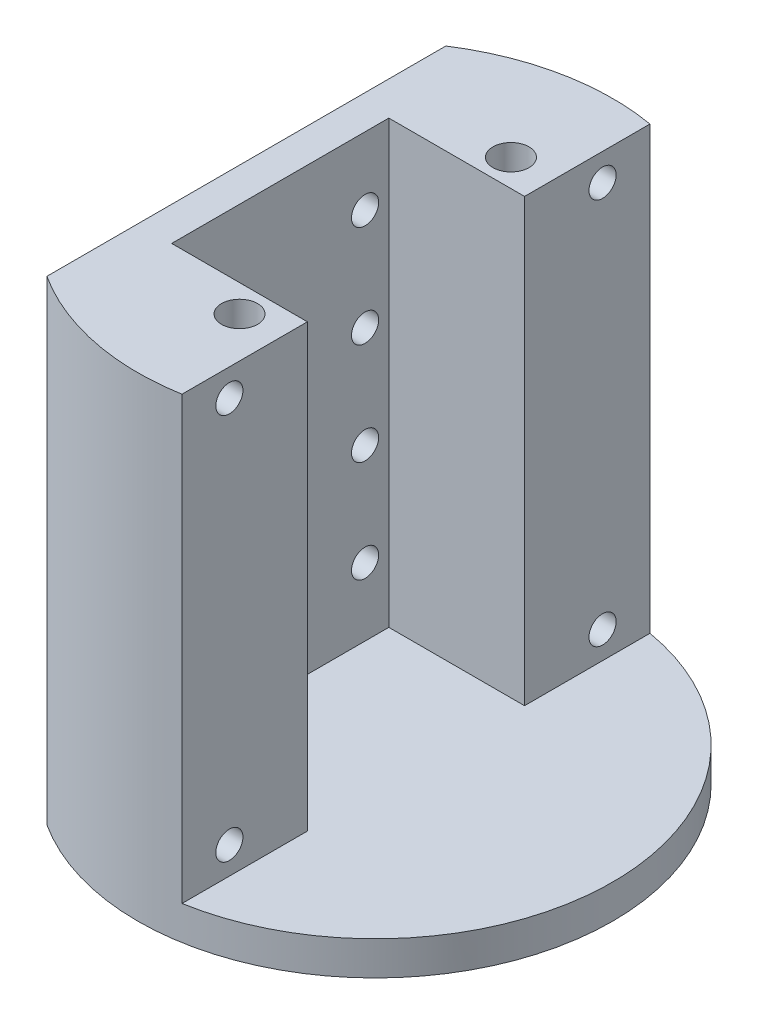
ISO-10303-21;
HEADER;
FILE_DESCRIPTION(('STEP AP214'),'2;1');
FILE_NAME('part.step','',(''),(''),'','','');
FILE_SCHEMA(('AUTOMOTIVE_DESIGN { 1 0 10303 214 1 1 1 1 }'));
ENDSEC;
DATA;
#1=APPLICATION_CONTEXT('core data for automotive mechanical design processes');
#2=APPLICATION_PROTOCOL_DEFINITION('international standard','automotive_design',2000,#1);
#3=PRODUCT_CONTEXT('',#1,'mechanical');
#4=PRODUCT('Part','Part','',(#3));
#5=PRODUCT_RELATED_PRODUCT_CATEGORY('part','',(#4));
#6=PRODUCT_DEFINITION_FORMATION('','',#4);
#7=PRODUCT_DEFINITION_CONTEXT('part definition',#1,'design');
#8=PRODUCT_DEFINITION('design','',#6,#7);
#9=PRODUCT_DEFINITION_SHAPE('','',#8);
#10=(LENGTH_UNIT() NAMED_UNIT(*) SI_UNIT(.MILLI.,.METRE.));
#11=(NAMED_UNIT(*) PLANE_ANGLE_UNIT() SI_UNIT($,.RADIAN.));
#12=(NAMED_UNIT(*) SI_UNIT($,.STERADIAN.) SOLID_ANGLE_UNIT());
#13=UNCERTAINTY_MEASURE_WITH_UNIT(LENGTH_MEASURE(1.E-05),#10,'distance_accuracy_value','');
#14=(GEOMETRIC_REPRESENTATION_CONTEXT(3) GLOBAL_UNCERTAINTY_ASSIGNED_CONTEXT((#13)) GLOBAL_UNIT_ASSIGNED_CONTEXT((#10,
#11,#12)) REPRESENTATION_CONTEXT('',''));
#15=CARTESIAN_POINT('',(0.,0.,0.));
#16=DIRECTION('',(0.,0.,1.));
#17=DIRECTION('',(1.,0.,0.));
#18=AXIS2_PLACEMENT_3D('',#15,#16,#17);
#19=CARTESIAN_POINT('',(7.62,88.9,0.));
#20=DIRECTION('',(-1.,0.,0.));
#21=DIRECTION('',(0.,0.,1.));
#22=AXIS2_PLACEMENT_3D('',#19,#20,#21);
#23=PLANE('',#22);
#24=CARTESIAN_POINT('',(7.62,11.43,-34.925));
#25=DIRECTION('',(1.,0.,0.));
#26=DIRECTION('',(0.,0.,-1.));
#27=AXIS2_PLACEMENT_3D('',#24,#25,#26);
#28=CIRCLE('',#27,2.54);
#29=CARTESIAN_POINT('',(7.62,11.43,-37.465));
#30=VERTEX_POINT('',#29);
#31=EDGE_CURVE('E147',#30,#30,#28,.T.);
#32=ORIENTED_EDGE('',*,*,#31,.F.);
#33=EDGE_LOOP('',(#32));
#34=FACE_BOUND('',#33,.T.);
#35=CARTESIAN_POINT('',(7.62,83.82,-34.925));
#36=DIRECTION('',(1.,0.,0.));
#37=DIRECTION('',(0.,0.,-1.));
#38=AXIS2_PLACEMENT_3D('',#35,#36,#37);
#39=CIRCLE('',#38,2.54);
#40=CARTESIAN_POINT('',(7.62,83.82,-37.465));
#41=VERTEX_POINT('',#40);
#42=EDGE_CURVE('E150',#41,#41,#39,.T.);
#43=ORIENTED_EDGE('',*,*,#42,.F.);
#44=EDGE_LOOP('',(#43));
#45=FACE_BOUND('',#44,.T.);
#46=DIRECTION('',(0.,0.,-1.));
#47=VECTOR('',#46,1.);
#48=CARTESIAN_POINT('',(7.62,6.35,-20.32));
#49=LINE('',#48,#47);
#50=CARTESIAN_POINT('',(7.62,6.34999999999999,-20.32));
#51=VERTEX_POINT('',#50);
#52=CARTESIAN_POINT('',(7.62,6.34999999999999,-43.7919867098993));
#53=VERTEX_POINT('',#52);
#54=EDGE_CURVE('E62',#51,#53,#49,.T.);
#55=ORIENTED_EDGE('',*,*,#54,.T.);
#56=DIRECTION('',(0.,-1.,0.));
#57=VECTOR('',#56,1.);
#58=CARTESIAN_POINT('',(7.62,88.9,-43.7919867098993));
#59=LINE('',#58,#57);
#60=CARTESIAN_POINT('',(7.62,88.9,-43.7919867098993));
#61=VERTEX_POINT('',#60);
#62=EDGE_CURVE('E11',#61,#53,#59,.T.);
#63=ORIENTED_EDGE('',*,*,#62,.F.);
#64=DIRECTION('',(0.,0.,-1.));
#65=VECTOR('',#64,1.);
#66=CARTESIAN_POINT('',(7.62,88.9,0.));
#67=LINE('',#66,#65);
#68=CARTESIAN_POINT('',(7.62,88.9,-20.32));
#69=VERTEX_POINT('',#68);
#70=EDGE_CURVE('E123',#69,#61,#67,.T.);
#71=ORIENTED_EDGE('',*,*,#70,.F.);
#72=DIRECTION('',(0.,-1.,0.));
#73=VECTOR('',#72,1.);
#74=CARTESIAN_POINT('',(7.62,88.9,-20.32));
#75=LINE('',#74,#73);
#76=EDGE_CURVE('E276',#69,#51,#75,.T.);
#77=ORIENTED_EDGE('',*,*,#76,.T.);
#78=EDGE_LOOP('',(#55,#63,#71,#77));
#79=FACE_BOUND('',#78,.T.);
#80=ADVANCED_FACE('F47',(#34,#45,#79),#23,.F.);
#81=CARTESIAN_POINT('',(7.62000000000001,88.9,0.));
#82=DIRECTION('',(1.,0.,0.));
#83=DIRECTION('',(0.,0.,-1.));
#84=AXIS2_PLACEMENT_3D('',#81,#82,#83);
#85=PLANE('',#84);
#86=CARTESIAN_POINT('',(7.62,11.43,34.925));
#87=DIRECTION('',(1.,0.,0.));
#88=DIRECTION('',(0.,0.,-1.));
#89=AXIS2_PLACEMENT_3D('',#86,#87,#88);
#90=CIRCLE('',#89,2.54);
#91=CARTESIAN_POINT('',(7.62,11.43,32.385));
#92=VERTEX_POINT('',#91);
#93=EDGE_CURVE('E638',#92,#92,#90,.T.);
#94=ORIENTED_EDGE('',*,*,#93,.F.);
#95=EDGE_LOOP('',(#94));
#96=FACE_BOUND('',#95,.T.);
#97=CARTESIAN_POINT('',(7.62,83.82,34.925));
#98=DIRECTION('',(1.,0.,0.));
#99=DIRECTION('',(0.,0.,-1.));
#100=AXIS2_PLACEMENT_3D('',#97,#98,#99);
#101=CIRCLE('',#100,2.54);
#102=CARTESIAN_POINT('',(7.62,83.82,32.385));
#103=VERTEX_POINT('',#102);
#104=EDGE_CURVE('E154',#103,#103,#101,.T.);
#105=ORIENTED_EDGE('',*,*,#104,.F.);
#106=EDGE_LOOP('',(#105));
#107=FACE_BOUND('',#106,.T.);
#108=DIRECTION('',(0.,-1.,0.));
#109=VECTOR('',#108,1.);
#110=CARTESIAN_POINT('',(7.62,88.9,43.7919867098993));
#111=LINE('',#110,#109);
#112=CARTESIAN_POINT('',(7.62,88.9,43.7919867098993));
#113=VERTEX_POINT('',#112);
#114=CARTESIAN_POINT('',(7.62,6.34999999999999,43.7919867098993));
#115=VERTEX_POINT('',#114);
#116=EDGE_CURVE('E69',#113,#115,#111,.T.);
#117=ORIENTED_EDGE('',*,*,#116,.T.);
#118=DIRECTION('',(0.,0.,-1.));
#119=VECTOR('',#118,1.);
#120=CARTESIAN_POINT('',(7.62,6.35,20.32));
#121=LINE('',#120,#119);
#122=CARTESIAN_POINT('',(7.62,6.34999999999999,20.32));
#123=VERTEX_POINT('',#122);
#124=EDGE_CURVE('E173',#115,#123,#121,.T.);
#125=ORIENTED_EDGE('',*,*,#124,.T.);
#126=DIRECTION('',(0.,-1.,0.));
#127=VECTOR('',#126,1.);
#128=CARTESIAN_POINT('',(7.62,88.9,20.32));
#129=LINE('',#128,#127);
#130=CARTESIAN_POINT('',(7.62,88.9,20.32));
#131=VERTEX_POINT('',#130);
#132=EDGE_CURVE('E291',#131,#123,#129,.T.);
#133=ORIENTED_EDGE('',*,*,#132,.F.);
#134=DIRECTION('',(0.,0.,1.));
#135=VECTOR('',#134,1.);
#136=CARTESIAN_POINT('',(7.62000000000001,88.9,0.));
#137=LINE('',#136,#135);
#138=EDGE_CURVE('E265',#131,#113,#137,.T.);
#139=ORIENTED_EDGE('',*,*,#138,.T.);
#140=EDGE_LOOP('',(#117,#125,#133,#139));
#141=FACE_BOUND('',#140,.T.);
#142=ADVANCED_FACE('F135',(#96,#107,#141),#85,.T.);
#143=CARTESIAN_POINT('',(0.,88.9,20.32));
#144=DIRECTION('',(0.,0.,1.));
#145=DIRECTION('',(1.,0.,0.));
#146=AXIS2_PLACEMENT_3D('',#143,#144,#145);
#147=PLANE('',#146);
#148=DIRECTION('',(-1.,0.,0.));
#149=VECTOR('',#148,1.);
#150=CARTESIAN_POINT('',(7.62,6.35,20.32));
#151=LINE('',#150,#149);
#152=CARTESIAN_POINT('',(-17.78,6.34999999999999,20.32));
#153=VERTEX_POINT('',#152);
#154=EDGE_CURVE('E176',#123,#153,#151,.T.);
#155=ORIENTED_EDGE('',*,*,#154,.T.);
#156=DIRECTION('',(0.,-1.,0.));
#157=VECTOR('',#156,1.);
#158=CARTESIAN_POINT('',(-17.78,88.9,20.32));
#159=LINE('',#158,#157);
#160=CARTESIAN_POINT('',(-17.78,88.9,20.32));
#161=VERTEX_POINT('',#160);
#162=EDGE_CURVE('E287',#161,#153,#159,.T.);
#163=ORIENTED_EDGE('',*,*,#162,.F.);
#164=DIRECTION('',(-1.,0.,0.));
#165=VECTOR('',#164,1.);
#166=CARTESIAN_POINT('',(0.,88.9,20.32));
#167=LINE('',#166,#165);
#168=EDGE_CURVE('E268',#131,#161,#167,.T.);
#169=ORIENTED_EDGE('',*,*,#168,.F.);
#170=ORIENTED_EDGE('',*,*,#132,.T.);
#171=EDGE_LOOP('',(#155,#163,#169,#170));
#172=FACE_BOUND('',#171,.T.);
#173=ADVANCED_FACE('F141',(#172),#147,.F.);
#174=CARTESIAN_POINT('',(-17.78,88.9,0.));
#175=DIRECTION('',(-1.,0.,0.));
#176=DIRECTION('',(0.,0.,1.));
#177=AXIS2_PLACEMENT_3D('',#174,#175,#176);
#178=PLANE('',#177);
#179=CARTESIAN_POINT('',(-17.78,76.2,15.8750000000005));
#180=DIRECTION('',(1.,0.,0.));
#181=DIRECTION('',(0.,0.,-1.));
#182=AXIS2_PLACEMENT_3D('',#179,#180,#181);
#183=CIRCLE('',#182,2.54);
#184=CARTESIAN_POINT('',(-17.78,76.2,13.3350000000005));
#185=VERTEX_POINT('',#184);
#186=EDGE_CURVE('E243',#185,#185,#183,.T.);
#187=ORIENTED_EDGE('',*,*,#186,.F.);
#188=EDGE_LOOP('',(#187));
#189=FACE_BOUND('',#188,.T.);
#190=CARTESIAN_POINT('',(-17.78,38.1,-15.8749999999999));
#191=DIRECTION('',(1.,0.,0.));
#192=DIRECTION('',(0.,0.,-1.));
#193=AXIS2_PLACEMENT_3D('',#190,#191,#192);
#194=CIRCLE('',#193,2.54);
#195=CARTESIAN_POINT('',(-17.78,38.1,-18.4149999999999));
#196=VERTEX_POINT('',#195);
#197=EDGE_CURVE('E207',#196,#196,#194,.T.);
#198=ORIENTED_EDGE('',*,*,#197,.F.);
#199=EDGE_LOOP('',(#198));
#200=FACE_BOUND('',#199,.T.);
#201=CARTESIAN_POINT('',(-17.78,19.05,15.8749999999999));
#202=DIRECTION('',(1.,0.,0.));
#203=DIRECTION('',(0.,0.,-1.));
#204=AXIS2_PLACEMENT_3D('',#201,#202,#203);
#205=CIRCLE('',#204,2.54);
#206=CARTESIAN_POINT('',(-17.78,19.05,13.3349999999999));
#207=VERTEX_POINT('',#206);
#208=EDGE_CURVE('E216',#207,#207,#205,.T.);
#209=ORIENTED_EDGE('',*,*,#208,.F.);
#210=EDGE_LOOP('',(#209));
#211=FACE_BOUND('',#210,.T.);
#212=CARTESIAN_POINT('',(-17.78,19.05,-15.8750000000001));
#213=DIRECTION('',(1.,0.,0.));
#214=DIRECTION('',(0.,0.,-1.));
#215=AXIS2_PLACEMENT_3D('',#212,#213,#214);
#216=CIRCLE('',#215,2.54);
#217=CARTESIAN_POINT('',(-17.78,19.05,-18.4150000000001));
#218=VERTEX_POINT('',#217);
#219=EDGE_CURVE('E199',#218,#218,#216,.T.);
#220=ORIENTED_EDGE('',*,*,#219,.F.);
#221=EDGE_LOOP('',(#220));
#222=FACE_BOUND('',#221,.T.);
#223=CARTESIAN_POINT('',(-17.78,76.2,-15.8749999999995));
#224=DIRECTION('',(1.,0.,0.));
#225=DIRECTION('',(0.,0.,-1.));
#226=AXIS2_PLACEMENT_3D('',#223,#224,#225);
#227=CIRCLE('',#226,2.54);
#228=CARTESIAN_POINT('',(-17.78,76.2,-18.4149999999995));
#229=VERTEX_POINT('',#228);
#230=EDGE_CURVE('E239',#229,#229,#227,.T.);
#231=ORIENTED_EDGE('',*,*,#230,.F.);
#232=EDGE_LOOP('',(#231));
#233=FACE_BOUND('',#232,.T.);
#234=CARTESIAN_POINT('',(-17.78,57.15,15.8750000000003));
#235=DIRECTION('',(1.,0.,0.));
#236=DIRECTION('',(0.,0.,-1.));
#237=AXIS2_PLACEMENT_3D('',#234,#235,#236);
#238=CIRCLE('',#237,2.54);
#239=CARTESIAN_POINT('',(-17.78,57.15,13.3350000000003));
#240=VERTEX_POINT('',#239);
#241=EDGE_CURVE('E248',#240,#240,#238,.T.);
#242=ORIENTED_EDGE('',*,*,#241,.F.);
#243=EDGE_LOOP('',(#242));
#244=FACE_BOUND('',#243,.T.);
#245=CARTESIAN_POINT('',(-17.78,57.15,-15.8749999999997));
#246=DIRECTION('',(1.,0.,0.));
#247=DIRECTION('',(0.,0.,-1.));
#248=AXIS2_PLACEMENT_3D('',#245,#246,#247);
#249=CIRCLE('',#248,2.54);
#250=CARTESIAN_POINT('',(-17.78,57.15,-18.4149999999997));
#251=VERTEX_POINT('',#250);
#252=EDGE_CURVE('E223',#251,#251,#249,.T.);
#253=ORIENTED_EDGE('',*,*,#252,.F.);
#254=EDGE_LOOP('',(#253));
#255=FACE_BOUND('',#254,.T.);
#256=CARTESIAN_POINT('',(-17.78,38.1,15.8750000000001));
#257=DIRECTION('',(1.,0.,0.));
#258=DIRECTION('',(0.,0.,-1.));
#259=AXIS2_PLACEMENT_3D('',#256,#257,#258);
#260=CIRCLE('',#259,2.54);
#261=CARTESIAN_POINT('',(-17.78,38.1,13.3350000000001));
#262=VERTEX_POINT('',#261);
#263=EDGE_CURVE('E232',#262,#262,#260,.T.);
#264=ORIENTED_EDGE('',*,*,#263,.F.);
#265=EDGE_LOOP('',(#264));
#266=FACE_BOUND('',#265,.T.);
#267=DIRECTION('',(0.,0.,-1.));
#268=VECTOR('',#267,1.);
#269=CARTESIAN_POINT('',(-17.78,6.35,20.32));
#270=LINE('',#269,#268);
#271=CARTESIAN_POINT('',(-17.78,6.34999999999999,-20.32));
#272=VERTEX_POINT('',#271);
#273=EDGE_CURVE('E179',#153,#272,#270,.T.);
#274=ORIENTED_EDGE('',*,*,#273,.T.);
#275=DIRECTION('',(0.,-1.,0.));
#276=VECTOR('',#275,1.);
#277=CARTESIAN_POINT('',(-17.78,88.9,-20.32));
#278=LINE('',#277,#276);
#279=CARTESIAN_POINT('',(-17.78,88.9,-20.32));
#280=VERTEX_POINT('',#279);
#281=EDGE_CURVE('E283',#280,#272,#278,.T.);
#282=ORIENTED_EDGE('',*,*,#281,.F.);
#283=DIRECTION('',(0.,0.,-1.));
#284=VECTOR('',#283,1.);
#285=CARTESIAN_POINT('',(-17.78,88.9,0.));
#286=LINE('',#285,#284);
#287=EDGE_CURVE('E271',#161,#280,#286,.T.);
#288=ORIENTED_EDGE('',*,*,#287,.F.);
#289=ORIENTED_EDGE('',*,*,#162,.T.);
#290=EDGE_LOOP('',(#274,#282,#288,#289));
#291=FACE_BOUND('',#290,.T.);
#292=ADVANCED_FACE('F320',(#189,#200,#211,#222,#233,#244,#255,#266,#291),#178,.F.);
#293=CARTESIAN_POINT('',(0.,88.9,-20.32));
#294=DIRECTION('',(0.,0.,1.));
#295=DIRECTION('',(1.,0.,0.));
#296=AXIS2_PLACEMENT_3D('',#293,#294,#295);
#297=PLANE('',#296);
#298=ORIENTED_EDGE('',*,*,#281,.T.);
#299=DIRECTION('',(1.,0.,0.));
#300=VECTOR('',#299,1.);
#301=CARTESIAN_POINT('',(7.62,6.35,-20.32));
#302=LINE('',#301,#300);
#303=EDGE_CURVE('E159',#272,#51,#302,.T.);
#304=ORIENTED_EDGE('',*,*,#303,.T.);
#305=ORIENTED_EDGE('',*,*,#76,.F.);
#306=DIRECTION('',(-1.,0.,0.));
#307=VECTOR('',#306,1.);
#308=CARTESIAN_POINT('',(0.,88.9,-20.32));
#309=LINE('',#308,#307);
#310=EDGE_CURVE('E130',#69,#280,#309,.T.);
#311=ORIENTED_EDGE('',*,*,#310,.T.);
#312=EDGE_LOOP('',(#298,#304,#305,#311));
#313=FACE_BOUND('',#312,.T.);
#314=ADVANCED_FACE('F323',(#313),#297,.T.);
#315=CARTESIAN_POINT('',(-24.13,88.9,0.));
#316=DIRECTION('',(1.,0.,0.));
#317=DIRECTION('',(0.,0.,-1.));
#318=AXIS2_PLACEMENT_3D('',#315,#316,#317);
#319=PLANE('',#318);
#320=DIRECTION('',(0.,0.,1.));
#321=VECTOR('',#320,1.);
#322=CARTESIAN_POINT('',(-24.13,0.,0.));
#323=LINE('',#322,#321);
#324=CARTESIAN_POINT('',(-24.13,0.,-37.3302236800156));
#325=VERTEX_POINT('',#324);
#326=CARTESIAN_POINT('',(-24.13,0.,37.3302236800156));
#327=VERTEX_POINT('',#326);
#328=EDGE_CURVE('E259',#325,#327,#323,.T.);
#329=ORIENTED_EDGE('',*,*,#328,.T.);
#330=DIRECTION('',(0.,-1.,0.));
#331=VECTOR('',#330,1.);
#332=CARTESIAN_POINT('',(-24.13,88.9,37.3302236800156));
#333=LINE('',#332,#331);
#334=CARTESIAN_POINT('',(-24.13,88.9,37.3302236800156));
#335=VERTEX_POINT('',#334);
#336=EDGE_CURVE('E297',#335,#327,#333,.T.);
#337=ORIENTED_EDGE('',*,*,#336,.F.);
#338=DIRECTION('',(0.,0.,1.));
#339=VECTOR('',#338,1.);
#340=CARTESIAN_POINT('',(-24.13,88.9,0.));
#341=LINE('',#340,#339);
#342=CARTESIAN_POINT('',(-24.13,88.9,-37.3302236800156));
#343=VERTEX_POINT('',#342);
#344=EDGE_CURVE('E122',#343,#335,#341,.T.);
#345=ORIENTED_EDGE('',*,*,#344,.F.);
#346=DIRECTION('',(0.,-1.,0.));
#347=VECTOR('',#346,1.);
#348=CARTESIAN_POINT('',(-24.13,88.9,-37.3302236800156));
#349=LINE('',#348,#347);
#350=EDGE_CURVE('E55',#343,#325,#349,.T.);
#351=ORIENTED_EDGE('',*,*,#350,.T.);
#352=EDGE_LOOP('',(#329,#337,#345,#351));
#353=FACE_BOUND('',#352,.T.);
#354=ADVANCED_FACE('F303',(#353),#319,.F.);
#355=CARTESIAN_POINT('',(0.,88.9,0.));
#356=DIRECTION('',(0.,-1.,0.));
#357=DIRECTION('',(0.,0.,-1.));
#358=AXIS2_PLACEMENT_3D('',#355,#356,#357);
#359=CYLINDRICAL_SURFACE('',#358,44.45);
#360=CARTESIAN_POINT('',(0.,0.,0.));
#361=DIRECTION('',(0.,1.,0.));
#362=DIRECTION('',(0.,0.,1.));
#363=AXIS2_PLACEMENT_3D('',#360,#361,#362);
#364=CIRCLE('',#363,44.45);
#365=EDGE_CURVE('E132',#327,#325,#364,.T.);
#366=ORIENTED_EDGE('',*,*,#365,.T.);
#367=ORIENTED_EDGE('',*,*,#350,.F.);
#368=CARTESIAN_POINT('',(0.,88.9,0.));
#369=DIRECTION('',(0.,1.,0.));
#370=DIRECTION('',(0.,0.,1.));
#371=AXIS2_PLACEMENT_3D('',#368,#369,#370);
#372=CIRCLE('',#371,44.45);
#373=EDGE_CURVE('E113',#61,#343,#372,.T.);
#374=ORIENTED_EDGE('',*,*,#373,.F.);
#375=ORIENTED_EDGE('',*,*,#62,.T.);
#376=CARTESIAN_POINT('',(0.,6.35,0.));
#377=DIRECTION('',(0.,-1.,0.));
#378=DIRECTION('',(0.,0.,-1.));
#379=AXIS2_PLACEMENT_3D('',#376,#377,#378);
#380=CIRCLE('',#379,44.45);
#381=EDGE_CURVE('E170',#53,#115,#380,.T.);
#382=ORIENTED_EDGE('',*,*,#381,.T.);
#383=ORIENTED_EDGE('',*,*,#116,.F.);
#384=EDGE_CURVE('E125',#335,#113,#372,.T.);
#385=ORIENTED_EDGE('',*,*,#384,.F.);
#386=ORIENTED_EDGE('',*,*,#336,.T.);
#387=EDGE_LOOP('',(#366,#367,#374,#375,#382,#383,#385,#386));
#388=FACE_BOUND('',#387,.T.);
#389=ADVANCED_FACE('F115',(#388),#359,.T.);
#390=CARTESIAN_POINT('',(0.,88.9,0.));
#391=DIRECTION('',(0.,1.,0.));
#392=DIRECTION('',(0.,0.,1.));
#393=AXIS2_PLACEMENT_3D('',#390,#391,#392);
#394=PLANE('',#393);
#395=CARTESIAN_POINT('',(0.,88.9,-25.4));
#396=DIRECTION('',(0.,1.,0.));
#397=DIRECTION('',(0.,0.,1.));
#398=AXIS2_PLACEMENT_3D('',#395,#396,#397);
#399=CIRCLE('',#398,3.37819999999999);
#400=CARTESIAN_POINT('',(0.,88.9,-22.0218));
#401=VERTEX_POINT('',#400);
#402=EDGE_CURVE('E182',#401,#401,#399,.T.);
#403=ORIENTED_EDGE('',*,*,#402,.F.);
#404=EDGE_LOOP('',(#403));
#405=FACE_BOUND('',#404,.T.);
#406=CARTESIAN_POINT('',(0.,88.9,25.4));
#407=DIRECTION('',(0.,1.,0.));
#408=DIRECTION('',(0.,0.,1.));
#409=AXIS2_PLACEMENT_3D('',#406,#407,#408);
#410=CIRCLE('',#409,3.37819999999999);
#411=CARTESIAN_POINT('',(0.,88.9,28.7782));
#412=VERTEX_POINT('',#411);
#413=EDGE_CURVE('E190',#412,#412,#410,.T.);
#414=ORIENTED_EDGE('',*,*,#413,.F.);
#415=EDGE_LOOP('',(#414));
#416=FACE_BOUND('',#415,.T.);
#417=ORIENTED_EDGE('',*,*,#70,.T.);
#418=ORIENTED_EDGE('',*,*,#373,.T.);
#419=ORIENTED_EDGE('',*,*,#344,.T.);
#420=ORIENTED_EDGE('',*,*,#384,.T.);
#421=ORIENTED_EDGE('',*,*,#138,.F.);
#422=ORIENTED_EDGE('',*,*,#168,.T.);
#423=ORIENTED_EDGE('',*,*,#287,.T.);
#424=ORIENTED_EDGE('',*,*,#310,.F.);
#425=EDGE_LOOP('',(#417,#418,#419,#420,#421,#422,#423,#424));
#426=FACE_BOUND('',#425,.T.);
#427=ADVANCED_FACE('F128',(#405,#416,#426),#394,.T.);
#428=CARTESIAN_POINT('',(0.,0.,0.));
#429=DIRECTION('',(0.,1.,0.));
#430=DIRECTION('',(0.,0.,1.));
#431=AXIS2_PLACEMENT_3D('',#428,#429,#430);
#432=PLANE('',#431);
#433=ORIENTED_EDGE('',*,*,#328,.F.);
#434=ORIENTED_EDGE('',*,*,#365,.F.);
#435=EDGE_LOOP('',(#433,#434));
#436=FACE_BOUND('',#435,.T.);
#437=CARTESIAN_POINT('',(0.,0.,-25.4));
#438=DIRECTION('',(0.,1.,0.));
#439=DIRECTION('',(0.,0.,1.));
#440=AXIS2_PLACEMENT_3D('',#437,#438,#439);
#441=CIRCLE('',#440,3.37819999999997);
#442=CARTESIAN_POINT('',(0.,0.,-22.0218));
#443=VERTEX_POINT('',#442);
#444=EDGE_CURVE('E186',#443,#443,#441,.T.);
#445=ORIENTED_EDGE('',*,*,#444,.T.);
#446=EDGE_LOOP('',(#445));
#447=FACE_BOUND('',#446,.T.);
#448=CARTESIAN_POINT('',(0.,0.,25.4));
#449=DIRECTION('',(0.,1.,0.));
#450=DIRECTION('',(0.,0.,1.));
#451=AXIS2_PLACEMENT_3D('',#448,#449,#450);
#452=CIRCLE('',#451,3.37819999999997);
#453=CARTESIAN_POINT('',(0.,0.,28.7782));
#454=VERTEX_POINT('',#453);
#455=EDGE_CURVE('E194',#454,#454,#452,.T.);
#456=ORIENTED_EDGE('',*,*,#455,.T.);
#457=EDGE_LOOP('',(#456));
#458=FACE_BOUND('',#457,.T.);
#459=ADVANCED_FACE('F307',(#436,#447,#458),#432,.F.);
#460=CARTESIAN_POINT('',(-22.225,76.2,15.8750000000005));
#461=DIRECTION('',(1.,0.,0.));
#462=DIRECTION('',(0.,0.,-1.));
#463=AXIS2_PLACEMENT_3D('',#460,#461,#462);
#464=CYLINDRICAL_SURFACE('',#463,2.54);
#465=CARTESIAN_POINT('',(-22.225,76.2,15.8750000000005));
#466=DIRECTION('',(1.,0.,0.));
#467=DIRECTION('',(0.,0.,-1.));
#468=AXIS2_PLACEMENT_3D('',#465,#466,#467);
#469=CIRCLE('',#468,2.54);
#470=CARTESIAN_POINT('',(-22.225,76.2,13.3350000000005));
#471=VERTEX_POINT('',#470);
#472=EDGE_CURVE('E255',#471,#471,#469,.T.);
#473=ORIENTED_EDGE('',*,*,#472,.F.);
#474=EDGE_LOOP('',(#473));
#475=FACE_BOUND('',#474,.T.);
#476=ORIENTED_EDGE('',*,*,#186,.T.);
#477=EDGE_LOOP('',(#476));
#478=FACE_BOUND('',#477,.T.);
#479=ADVANCED_FACE('F406',(#475,#478),#464,.F.);
#480=CARTESIAN_POINT('',(-22.225,76.2,15.8750000000005));
#481=DIRECTION('',(1.,0.,0.));
#482=DIRECTION('',(0.,0.,-1.));
#483=AXIS2_PLACEMENT_3D('',#480,#481,#482);
#484=PLANE('',#483);
#485=ORIENTED_EDGE('',*,*,#472,.T.);
#486=EDGE_LOOP('',(#485));
#487=FACE_BOUND('',#486,.T.);
#488=ADVANCED_FACE('F362',(#487),#484,.T.);
#489=CARTESIAN_POINT('',(-22.225,38.1,-15.8749999999999));
#490=DIRECTION('',(1.,0.,0.));
#491=DIRECTION('',(0.,0.,-1.));
#492=AXIS2_PLACEMENT_3D('',#489,#490,#491);
#493=CYLINDRICAL_SURFACE('',#492,2.54);
#494=CARTESIAN_POINT('',(-22.225,38.1,-15.8749999999999));
#495=DIRECTION('',(1.,0.,0.));
#496=DIRECTION('',(0.,0.,-1.));
#497=AXIS2_PLACEMENT_3D('',#494,#495,#496);
#498=CIRCLE('',#497,2.54);
#499=CARTESIAN_POINT('',(-22.225,38.1,-18.4149999999999));
#500=VERTEX_POINT('',#499);
#501=EDGE_CURVE('E212',#500,#500,#498,.T.);
#502=ORIENTED_EDGE('',*,*,#501,.F.);
#503=EDGE_LOOP('',(#502));
#504=FACE_BOUND('',#503,.T.);
#505=ORIENTED_EDGE('',*,*,#197,.T.);
#506=EDGE_LOOP('',(#505));
#507=FACE_BOUND('',#506,.T.);
#508=ADVANCED_FACE('F358',(#504,#507),#493,.F.);
#509=CARTESIAN_POINT('',(-22.225,38.1,-15.8749999999999));
#510=DIRECTION('',(1.,0.,0.));
#511=DIRECTION('',(0.,0.,-1.));
#512=AXIS2_PLACEMENT_3D('',#509,#510,#511);
#513=PLANE('',#512);
#514=ORIENTED_EDGE('',*,*,#501,.T.);
#515=EDGE_LOOP('',(#514));
#516=FACE_BOUND('',#515,.T.);
#517=ADVANCED_FACE('F361',(#516),#513,.T.);
#518=CARTESIAN_POINT('',(-22.225,19.05,15.8749999999999));
#519=DIRECTION('',(1.,0.,0.));
#520=DIRECTION('',(0.,0.,-1.));
#521=AXIS2_PLACEMENT_3D('',#518,#519,#520);
#522=CYLINDRICAL_SURFACE('',#521,2.54);
#523=CARTESIAN_POINT('',(-22.225,19.05,15.8749999999999));
#524=DIRECTION('',(1.,0.,0.));
#525=DIRECTION('',(0.,0.,-1.));
#526=AXIS2_PLACEMENT_3D('',#523,#524,#525);
#527=CIRCLE('',#526,2.54);
#528=CARTESIAN_POINT('',(-22.225,19.05,13.3349999999999));
#529=VERTEX_POINT('',#528);
#530=EDGE_CURVE('E203',#529,#529,#527,.T.);
#531=ORIENTED_EDGE('',*,*,#530,.F.);
#532=EDGE_LOOP('',(#531));
#533=FACE_BOUND('',#532,.T.);
#534=ORIENTED_EDGE('',*,*,#208,.T.);
#535=EDGE_LOOP('',(#534));
#536=FACE_BOUND('',#535,.T.);
#537=ADVANCED_FACE('F366',(#533,#536),#522,.F.);
#538=CARTESIAN_POINT('',(-22.225,19.05,15.8749999999999));
#539=DIRECTION('',(1.,0.,0.));
#540=DIRECTION('',(0.,0.,-1.));
#541=AXIS2_PLACEMENT_3D('',#538,#539,#540);
#542=PLANE('',#541);
#543=ORIENTED_EDGE('',*,*,#530,.T.);
#544=EDGE_LOOP('',(#543));
#545=FACE_BOUND('',#544,.T.);
#546=ADVANCED_FACE('F352',(#545),#542,.T.);
#547=CARTESIAN_POINT('',(-22.225,19.05,-15.8750000000001));
#548=DIRECTION('',(1.,0.,0.));
#549=DIRECTION('',(0.,0.,-1.));
#550=AXIS2_PLACEMENT_3D('',#547,#548,#549);
#551=CYLINDRICAL_SURFACE('',#550,2.54);
#552=CARTESIAN_POINT('',(-22.225,19.05,-15.8750000000001));
#553=DIRECTION('',(1.,0.,0.));
#554=DIRECTION('',(0.,0.,-1.));
#555=AXIS2_PLACEMENT_3D('',#552,#553,#554);
#556=CIRCLE('',#555,2.54);
#557=CARTESIAN_POINT('',(-22.225,19.05,-18.4150000000001));
#558=VERTEX_POINT('',#557);
#559=EDGE_CURVE('E198',#558,#558,#556,.T.);
#560=ORIENTED_EDGE('',*,*,#559,.F.);
#561=EDGE_LOOP('',(#560));
#562=FACE_BOUND('',#561,.T.);
#563=ORIENTED_EDGE('',*,*,#219,.T.);
#564=EDGE_LOOP('',(#563));
#565=FACE_BOUND('',#564,.T.);
#566=ADVANCED_FACE('F348',(#562,#565),#551,.F.);
#567=CARTESIAN_POINT('',(-22.225,19.05,-15.8750000000001));
#568=DIRECTION('',(1.,0.,0.));
#569=DIRECTION('',(0.,0.,-1.));
#570=AXIS2_PLACEMENT_3D('',#567,#568,#569);
#571=PLANE('',#570);
#572=ORIENTED_EDGE('',*,*,#559,.T.);
#573=EDGE_LOOP('',(#572));
#574=FACE_BOUND('',#573,.T.);
#575=ADVANCED_FACE('F351',(#574),#571,.T.);
#576=CARTESIAN_POINT('',(-22.225,76.2,-15.8749999999995));
#577=DIRECTION('',(1.,0.,0.));
#578=DIRECTION('',(0.,0.,-1.));
#579=AXIS2_PLACEMENT_3D('',#576,#577,#578);
#580=CYLINDRICAL_SURFACE('',#579,2.54);
#581=CARTESIAN_POINT('',(-22.225,76.2,-15.8749999999995));
#582=DIRECTION('',(1.,0.,0.));
#583=DIRECTION('',(0.,0.,-1.));
#584=AXIS2_PLACEMENT_3D('',#581,#582,#583);
#585=CIRCLE('',#584,2.54);
#586=CARTESIAN_POINT('',(-22.225,76.2,-18.4149999999995));
#587=VERTEX_POINT('',#586);
#588=EDGE_CURVE('E244',#587,#587,#585,.T.);
#589=ORIENTED_EDGE('',*,*,#588,.F.);
#590=EDGE_LOOP('',(#589));
#591=FACE_BOUND('',#590,.T.);
#592=ORIENTED_EDGE('',*,*,#230,.T.);
#593=EDGE_LOOP('',(#592));
#594=FACE_BOUND('',#593,.T.);
#595=ADVANCED_FACE('F356',(#591,#594),#580,.F.);
#596=CARTESIAN_POINT('',(-22.225,76.2,-15.8749999999995));
#597=DIRECTION('',(1.,0.,0.));
#598=DIRECTION('',(0.,0.,-1.));
#599=AXIS2_PLACEMENT_3D('',#596,#597,#598);
#600=PLANE('',#599);
#601=ORIENTED_EDGE('',*,*,#588,.T.);
#602=EDGE_LOOP('',(#601));
#603=FACE_BOUND('',#602,.T.);
#604=ADVANCED_FACE('F392',(#603),#600,.T.);
#605=CARTESIAN_POINT('',(-22.225,57.15,15.8750000000003));
#606=DIRECTION('',(1.,0.,0.));
#607=DIRECTION('',(0.,0.,-1.));
#608=AXIS2_PLACEMENT_3D('',#605,#606,#607);
#609=CYLINDRICAL_SURFACE('',#608,2.54);
#610=CARTESIAN_POINT('',(-22.225,57.15,15.8750000000003));
#611=DIRECTION('',(1.,0.,0.));
#612=DIRECTION('',(0.,0.,-1.));
#613=AXIS2_PLACEMENT_3D('',#610,#611,#612);
#614=CIRCLE('',#613,2.54);
#615=CARTESIAN_POINT('',(-22.225,57.15,13.3350000000003));
#616=VERTEX_POINT('',#615);
#617=EDGE_CURVE('E227',#616,#616,#614,.T.);
#618=ORIENTED_EDGE('',*,*,#617,.F.);
#619=EDGE_LOOP('',(#618));
#620=FACE_BOUND('',#619,.T.);
#621=ORIENTED_EDGE('',*,*,#241,.T.);
#622=EDGE_LOOP('',(#621));
#623=FACE_BOUND('',#622,.T.);
#624=ADVANCED_FACE('F396',(#620,#623),#609,.F.);
#625=CARTESIAN_POINT('',(-22.225,57.15,15.8750000000003));
#626=DIRECTION('',(1.,0.,0.));
#627=DIRECTION('',(0.,0.,-1.));
#628=AXIS2_PLACEMENT_3D('',#625,#626,#627);
#629=PLANE('',#628);
#630=ORIENTED_EDGE('',*,*,#617,.T.);
#631=EDGE_LOOP('',(#630));
#632=FACE_BOUND('',#631,.T.);
#633=ADVANCED_FACE('F378',(#632),#629,.T.);
#634=CARTESIAN_POINT('',(-22.225,57.15,-15.8749999999997));
#635=DIRECTION('',(1.,0.,0.));
#636=DIRECTION('',(0.,0.,-1.));
#637=AXIS2_PLACEMENT_3D('',#634,#635,#636);
#638=CYLINDRICAL_SURFACE('',#637,2.54);
#639=CARTESIAN_POINT('',(-22.225,57.15,-15.8749999999997));
#640=DIRECTION('',(1.,0.,0.));
#641=DIRECTION('',(0.,0.,-1.));
#642=AXIS2_PLACEMENT_3D('',#639,#640,#641);
#643=CIRCLE('',#642,2.54);
#644=CARTESIAN_POINT('',(-22.225,57.15,-18.4149999999997));
#645=VERTEX_POINT('',#644);
#646=EDGE_CURVE('E228',#645,#645,#643,.T.);
#647=ORIENTED_EDGE('',*,*,#646,.F.);
#648=EDGE_LOOP('',(#647));
#649=FACE_BOUND('',#648,.T.);
#650=ORIENTED_EDGE('',*,*,#252,.T.);
#651=EDGE_LOOP('',(#650));
#652=FACE_BOUND('',#651,.T.);
#653=ADVANCED_FACE('F374',(#649,#652),#638,.F.);
#654=CARTESIAN_POINT('',(-22.225,57.15,-15.8749999999997));
#655=DIRECTION('',(1.,0.,0.));
#656=DIRECTION('',(0.,0.,-1.));
#657=AXIS2_PLACEMENT_3D('',#654,#655,#656);
#658=PLANE('',#657);
#659=ORIENTED_EDGE('',*,*,#646,.T.);
#660=EDGE_LOOP('',(#659));
#661=FACE_BOUND('',#660,.T.);
#662=ADVANCED_FACE('F377',(#661),#658,.T.);
#663=CARTESIAN_POINT('',(-22.225,38.1,15.8750000000001));
#664=DIRECTION('',(1.,0.,0.));
#665=DIRECTION('',(0.,0.,-1.));
#666=AXIS2_PLACEMENT_3D('',#663,#664,#665);
#667=CYLINDRICAL_SURFACE('',#666,2.54);
#668=CARTESIAN_POINT('',(-22.225,38.1,15.8750000000001));
#669=DIRECTION('',(1.,0.,0.));
#670=DIRECTION('',(0.,0.,-1.));
#671=AXIS2_PLACEMENT_3D('',#668,#669,#670);
#672=CIRCLE('',#671,2.54);
#673=CARTESIAN_POINT('',(-22.225,38.1,13.3350000000001));
#674=VERTEX_POINT('',#673);
#675=EDGE_CURVE('E211',#674,#674,#672,.T.);
#676=ORIENTED_EDGE('',*,*,#675,.F.);
#677=EDGE_LOOP('',(#676));
#678=FACE_BOUND('',#677,.T.);
#679=ORIENTED_EDGE('',*,*,#263,.T.);
#680=EDGE_LOOP('',(#679));
#681=FACE_BOUND('',#680,.T.);
#682=ADVANCED_FACE('F382',(#678,#681),#667,.F.);
#683=CARTESIAN_POINT('',(-22.225,38.1,15.8750000000001));
#684=DIRECTION('',(1.,0.,0.));
#685=DIRECTION('',(0.,0.,-1.));
#686=AXIS2_PLACEMENT_3D('',#683,#684,#685);
#687=PLANE('',#686);
#688=ORIENTED_EDGE('',*,*,#675,.T.);
#689=EDGE_LOOP('',(#688));
#690=FACE_BOUND('',#689,.T.);
#691=ADVANCED_FACE('F346',(#690),#687,.T.);
#692=CARTESIAN_POINT('',(0.,88.9,25.4));
#693=DIRECTION('',(0.,1.,0.));
#694=DIRECTION('',(0.,0.,1.));
#695=AXIS2_PLACEMENT_3D('',#692,#693,#694);
#696=CYLINDRICAL_SURFACE('',#695,3.37819999999998);
#697=ORIENTED_EDGE('',*,*,#455,.F.);
#698=EDGE_LOOP('',(#697));
#699=FACE_BOUND('',#698,.T.);
#700=ORIENTED_EDGE('',*,*,#413,.T.);
#701=EDGE_LOOP('',(#700));
#702=FACE_BOUND('',#701,.T.);
#703=ADVANCED_FACE('F337',(#699,#702),#696,.F.);
#704=CARTESIAN_POINT('',(0.,88.9,-25.4));
#705=DIRECTION('',(0.,1.,0.));
#706=DIRECTION('',(0.,0.,1.));
#707=AXIS2_PLACEMENT_3D('',#704,#705,#706);
#708=CYLINDRICAL_SURFACE('',#707,3.37819999999998);
#709=ORIENTED_EDGE('',*,*,#444,.F.);
#710=EDGE_LOOP('',(#709));
#711=FACE_BOUND('',#710,.T.);
#712=ORIENTED_EDGE('',*,*,#402,.T.);
#713=EDGE_LOOP('',(#712));
#714=FACE_BOUND('',#713,.T.);
#715=ADVANCED_FACE('F327',(#711,#714),#708,.F.);
#716=CARTESIAN_POINT('',(0.,6.35,0.));
#717=DIRECTION('',(0.,-1.,0.));
#718=DIRECTION('',(0.,0.,-1.));
#719=AXIS2_PLACEMENT_3D('',#716,#717,#718);
#720=PLANE('',#719);
#721=ORIENTED_EDGE('',*,*,#303,.F.);
#722=ORIENTED_EDGE('',*,*,#273,.F.);
#723=ORIENTED_EDGE('',*,*,#154,.F.);
#724=ORIENTED_EDGE('',*,*,#124,.F.);
#725=ORIENTED_EDGE('',*,*,#381,.F.);
#726=ORIENTED_EDGE('',*,*,#54,.F.);
#727=EDGE_LOOP('',(#721,#722,#723,#724,#725,#726));
#728=FACE_BOUND('',#727,.T.);
#729=ADVANCED_FACE('F325',(#728),#720,.F.);
#730=CARTESIAN_POINT('',(3.175,83.82,34.925));
#731=DIRECTION('',(1.,0.,0.));
#732=DIRECTION('',(0.,0.,-1.));
#733=AXIS2_PLACEMENT_3D('',#730,#731,#732);
#734=CYLINDRICAL_SURFACE('',#733,2.54);
#735=CARTESIAN_POINT('',(3.175,83.82,34.925));
#736=DIRECTION('',(1.,0.,0.));
#737=DIRECTION('',(0.,0.,-1.));
#738=AXIS2_PLACEMENT_3D('',#735,#736,#737);
#739=CIRCLE('',#738,2.54);
#740=CARTESIAN_POINT('',(3.175,83.82,32.385));
#741=VERTEX_POINT('',#740);
#742=EDGE_CURVE('E162',#741,#741,#739,.T.);
#743=ORIENTED_EDGE('',*,*,#742,.F.);
#744=EDGE_LOOP('',(#743));
#745=FACE_BOUND('',#744,.T.);
#746=ORIENTED_EDGE('',*,*,#104,.T.);
#747=EDGE_LOOP('',(#746));
#748=FACE_BOUND('',#747,.T.);
#749=ADVANCED_FACE('F326',(#745,#748),#734,.F.);
#750=CARTESIAN_POINT('',(3.175,83.82,34.925));
#751=DIRECTION('',(1.,0.,0.));
#752=DIRECTION('',(0.,0.,-1.));
#753=AXIS2_PLACEMENT_3D('',#750,#751,#752);
#754=PLANE('',#753);
#755=ORIENTED_EDGE('',*,*,#742,.T.);
#756=EDGE_LOOP('',(#755));
#757=FACE_BOUND('',#756,.T.);
#758=ADVANCED_FACE('F333',(#757),#754,.T.);
#759=CARTESIAN_POINT('',(3.175,11.43,34.925));
#760=DIRECTION('',(1.,0.,0.));
#761=DIRECTION('',(0.,0.,-1.));
#762=AXIS2_PLACEMENT_3D('',#759,#760,#761);
#763=CYLINDRICAL_SURFACE('',#762,2.54);
#764=CARTESIAN_POINT('',(3.175,11.43,34.925));
#765=DIRECTION('',(1.,0.,0.));
#766=DIRECTION('',(0.,0.,-1.));
#767=AXIS2_PLACEMENT_3D('',#764,#765,#766);
#768=CIRCLE('',#767,2.54);
#769=CARTESIAN_POINT('',(3.175,11.43,32.385));
#770=VERTEX_POINT('',#769);
#771=EDGE_CURVE('E632',#770,#770,#768,.T.);
#772=ORIENTED_EDGE('',*,*,#771,.F.);
#773=EDGE_LOOP('',(#772));
#774=FACE_BOUND('',#773,.T.);
#775=ORIENTED_EDGE('',*,*,#93,.T.);
#776=EDGE_LOOP('',(#775));
#777=FACE_BOUND('',#776,.T.);
#778=ADVANCED_FACE('F567',(#774,#777),#763,.F.);
#779=CARTESIAN_POINT('',(3.175,11.43,34.925));
#780=DIRECTION('',(1.,0.,0.));
#781=DIRECTION('',(0.,0.,-1.));
#782=AXIS2_PLACEMENT_3D('',#779,#780,#781);
#783=PLANE('',#782);
#784=ORIENTED_EDGE('',*,*,#771,.T.);
#785=EDGE_LOOP('',(#784));
#786=FACE_BOUND('',#785,.T.);
#787=ADVANCED_FACE('F577',(#786),#783,.T.);
#788=CARTESIAN_POINT('',(3.175,83.82,-34.925));
#789=DIRECTION('',(1.,0.,0.));
#790=DIRECTION('',(0.,0.,-1.));
#791=AXIS2_PLACEMENT_3D('',#788,#789,#790);
#792=CYLINDRICAL_SURFACE('',#791,2.54);
#793=CARTESIAN_POINT('',(3.175,83.82,-34.925));
#794=DIRECTION('',(1.,0.,0.));
#795=DIRECTION('',(0.,0.,-1.));
#796=AXIS2_PLACEMENT_3D('',#793,#794,#795);
#797=CIRCLE('',#796,2.54);
#798=CARTESIAN_POINT('',(3.175,83.82,-37.465));
#799=VERTEX_POINT('',#798);
#800=EDGE_CURVE('E153',#799,#799,#797,.T.);
#801=ORIENTED_EDGE('',*,*,#800,.F.);
#802=EDGE_LOOP('',(#801));
#803=FACE_BOUND('',#802,.T.);
#804=ORIENTED_EDGE('',*,*,#42,.T.);
#805=EDGE_LOOP('',(#804));
#806=FACE_BOUND('',#805,.T.);
#807=ADVANCED_FACE('F341',(#803,#806),#792,.F.);
#808=CARTESIAN_POINT('',(3.175,83.82,-34.925));
#809=DIRECTION('',(1.,0.,0.));
#810=DIRECTION('',(0.,0.,-1.));
#811=AXIS2_PLACEMENT_3D('',#808,#809,#810);
#812=PLANE('',#811);
#813=ORIENTED_EDGE('',*,*,#800,.T.);
#814=EDGE_LOOP('',(#813));
#815=FACE_BOUND('',#814,.T.);
#816=ADVANCED_FACE('F596',(#815),#812,.T.);
#817=CARTESIAN_POINT('',(3.175,11.43,-34.925));
#818=DIRECTION('',(1.,0.,0.));
#819=DIRECTION('',(0.,0.,-1.));
#820=AXIS2_PLACEMENT_3D('',#817,#818,#819);
#821=CYLINDRICAL_SURFACE('',#820,2.54);
#822=CARTESIAN_POINT('',(3.175,11.43,-34.925));
#823=DIRECTION('',(1.,0.,0.));
#824=DIRECTION('',(0.,0.,-1.));
#825=AXIS2_PLACEMENT_3D('',#822,#823,#824);
#826=CIRCLE('',#825,2.54);
#827=CARTESIAN_POINT('',(3.175,11.43,-37.465));
#828=VERTEX_POINT('',#827);
#829=EDGE_CURVE('E629',#828,#828,#826,.T.);
#830=ORIENTED_EDGE('',*,*,#829,.F.);
#831=EDGE_LOOP('',(#830));
#832=FACE_BOUND('',#831,.T.);
#833=ORIENTED_EDGE('',*,*,#31,.T.);
#834=EDGE_LOOP('',(#833));
#835=FACE_BOUND('',#834,.T.);
#836=ADVANCED_FACE('F605',(#832,#835),#821,.F.);
#837=CARTESIAN_POINT('',(3.175,11.43,-34.925));
#838=DIRECTION('',(1.,0.,0.));
#839=DIRECTION('',(0.,0.,-1.));
#840=AXIS2_PLACEMENT_3D('',#837,#838,#839);
#841=PLANE('',#840);
#842=ORIENTED_EDGE('',*,*,#829,.T.);
#843=EDGE_LOOP('',(#842));
#844=FACE_BOUND('',#843,.T.);
#845=ADVANCED_FACE('F614',(#844),#841,.T.);
#846=CLOSED_SHELL('',(#80,#142,#173,#292,#314,#354,#389,#427,#459,#479,#488,#508,#517,#537,#546,
#566,#575,#595,#604,#624,#633,#653,#662,#682,#691,#703,#715,#729,#749,#758,#778,#787,#807,#816,
#836,#845));
#847=MANIFOLD_SOLID_BREP('B2',#846);
#848=ADVANCED_BREP_SHAPE_REPRESENTATION('',(#18,#847),#14);
#849=SHAPE_DEFINITION_REPRESENTATION(#9,#848);
ENDSEC;
END-ISO-10303-21;
